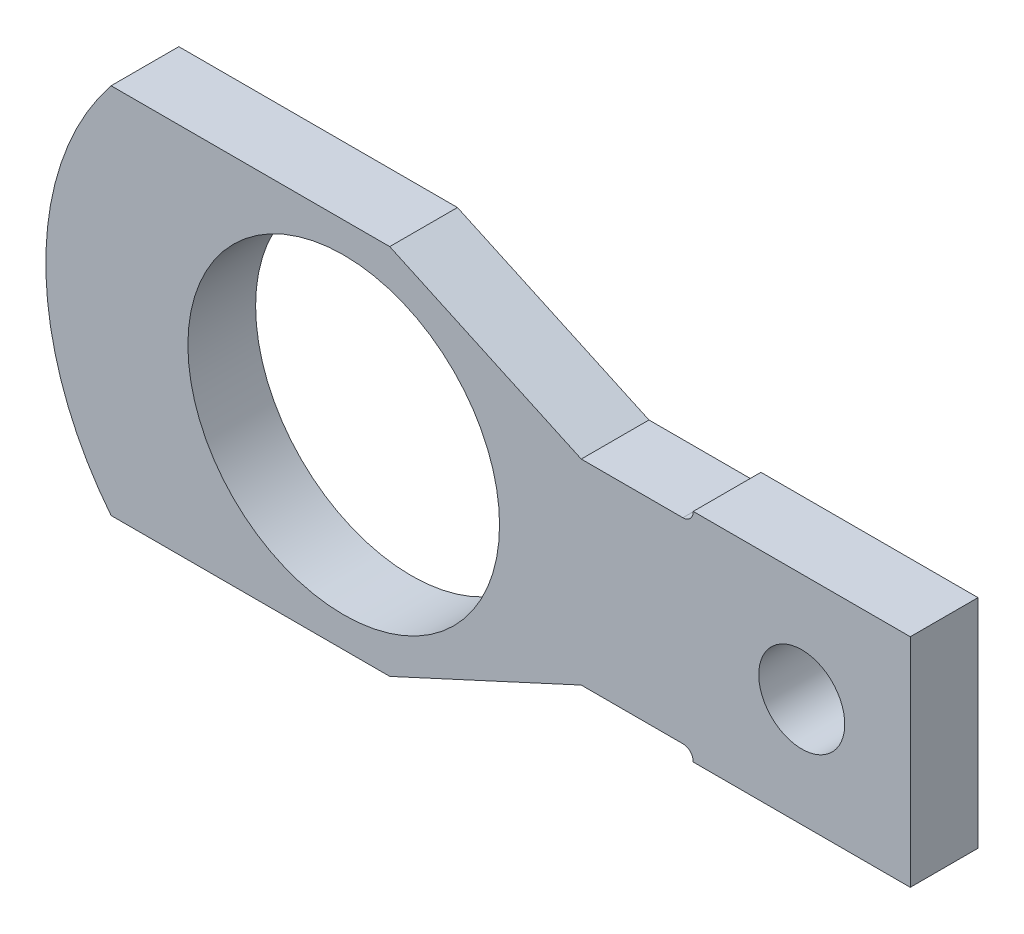
ISO-10303-21;
HEADER;
FILE_DESCRIPTION(('STEP AP214'),'2;1');
FILE_NAME('part.step','',(''),(''),'','','');
FILE_SCHEMA(('AUTOMOTIVE_DESIGN { 1 0 10303 214 1 1 1 1 }'));
ENDSEC;
DATA;
#1=APPLICATION_CONTEXT('core data for automotive mechanical design processes');
#2=APPLICATION_PROTOCOL_DEFINITION('international standard','automotive_design',2000,#1);
#3=PRODUCT_CONTEXT('',#1,'mechanical');
#4=PRODUCT('Part','Part','',(#3));
#5=PRODUCT_RELATED_PRODUCT_CATEGORY('part','',(#4));
#6=PRODUCT_DEFINITION_FORMATION('','',#4);
#7=PRODUCT_DEFINITION_CONTEXT('part definition',#1,'design');
#8=PRODUCT_DEFINITION('design','',#6,#7);
#9=PRODUCT_DEFINITION_SHAPE('','',#8);
#10=(LENGTH_UNIT() NAMED_UNIT(*) SI_UNIT(.MILLI.,.METRE.));
#11=(NAMED_UNIT(*) PLANE_ANGLE_UNIT() SI_UNIT($,.RADIAN.));
#12=(NAMED_UNIT(*) SI_UNIT($,.STERADIAN.) SOLID_ANGLE_UNIT());
#13=UNCERTAINTY_MEASURE_WITH_UNIT(LENGTH_MEASURE(1.E-05),#10,'distance_accuracy_value','');
#14=(GEOMETRIC_REPRESENTATION_CONTEXT(3) GLOBAL_UNCERTAINTY_ASSIGNED_CONTEXT((#13)) GLOBAL_UNIT_ASSIGNED_CONTEXT((#10,
#11,#12)) REPRESENTATION_CONTEXT('',''));
#15=CARTESIAN_POINT('',(0.,0.,0.));
#16=DIRECTION('',(0.,0.,1.));
#17=DIRECTION('',(1.,0.,0.));
#18=AXIS2_PLACEMENT_3D('',#15,#16,#17);
#19=CARTESIAN_POINT('',(250.444,79.8830000000009,50.));
#20=DIRECTION('',(0.,0.,1.));
#21=DIRECTION('',(0.,1.,0.));
#22=AXIS2_PLACEMENT_3D('',#19,#20,#21);
#23=PLANE('',#22);
#24=CARTESIAN_POINT('',(338.201,1.23936402628837E-12,50.));
#25=DIRECTION('',(0.,0.,1.));
#26=DIRECTION('',(0.,1.,0.));
#27=AXIS2_PLACEMENT_3D('',#24,#25,#26);
#28=CIRCLE('',#27,31.75);
#29=CARTESIAN_POINT('',(338.201,31.7500000000013,50.));
#30=VERTEX_POINT('',#29);
#31=EDGE_CURVE('E288',#30,#30,#28,.T.);
#32=ORIENTED_EDGE('',*,*,#31,.F.);
#33=EDGE_LOOP('',(#32));
#34=FACE_BOUND('',#33,.T.);
#35=DIRECTION('',(1.,0.,0.));
#36=VECTOR('',#35,1.);
#37=CARTESIAN_POINT('',(-171.760163891399,137.413999999999,50.));
#38=LINE('',#37,#36);
#39=CARTESIAN_POINT('',(-171.760163891399,137.413999999999,50.));
#40=VERTEX_POINT('',#39);
#41=CARTESIAN_POINT('',(33.9798361086012,137.414,50.));
#42=VERTEX_POINT('',#41);
#43=EDGE_CURVE('E331',#40,#42,#38,.T.);
#44=ORIENTED_EDGE('',*,*,#43,.F.);
#45=CARTESIAN_POINT('',(0.,0.,50.));
#46=DIRECTION('',(0.,0.,1.));
#47=DIRECTION('',(0.,1.,0.));
#48=AXIS2_PLACEMENT_3D('',#45,#46,#47);
#49=CIRCLE('',#48,219.964);
#50=CARTESIAN_POINT('',(-171.760163891398,-137.414000000001,50.));
#51=VERTEX_POINT('',#50);
#52=EDGE_CURVE('E257',#40,#51,#49,.T.);
#53=ORIENTED_EDGE('',*,*,#52,.T.);
#54=DIRECTION('',(1.,0.,0.));
#55=VECTOR('',#54,1.);
#56=CARTESIAN_POINT('',(-171.760163891398,-137.414000000001,50.));
#57=LINE('',#56,#55);
#58=CARTESIAN_POINT('',(33.9798361086022,-137.414,50.));
#59=VERTEX_POINT('',#58);
#60=EDGE_CURVE('E249',#51,#59,#57,.T.);
#61=ORIENTED_EDGE('',*,*,#60,.T.);
#62=DIRECTION('',(0.908247237806105,0.418433931484506,0.));
#63=VECTOR('',#62,1.);
#64=CARTESIAN_POINT('',(33.9798361086022,-137.414,50.));
#65=LINE('',#64,#63);
#66=CARTESIAN_POINT('',(175.395747529488,-72.2629999999993,50.));
#67=VERTEX_POINT('',#66);
#68=EDGE_CURVE('E255',#59,#67,#65,.T.);
#69=ORIENTED_EDGE('',*,*,#68,.T.);
#70=DIRECTION('',(-1.,0.,0.));
#71=VECTOR('',#70,1.);
#72=CARTESIAN_POINT('',(250.444,-72.2629999999991,50.));
#73=LINE('',#72,#71);
#74=CARTESIAN_POINT('',(250.444,-72.2629999999991,50.));
#75=VERTEX_POINT('',#74);
#76=EDGE_CURVE('E274',#75,#67,#73,.T.);
#77=ORIENTED_EDGE('',*,*,#76,.F.);
#78=CARTESIAN_POINT('',(250.444,-79.8829999999991,50.));
#79=DIRECTION('',(0.,0.,-1.));
#80=DIRECTION('',(0.,-1.,0.));
#81=AXIS2_PLACEMENT_3D('',#78,#79,#80);
#82=CIRCLE('',#81,7.62000000000001);
#83=CARTESIAN_POINT('',(258.064,-79.8829999999991,50.));
#84=VERTEX_POINT('',#83);
#85=EDGE_CURVE('E277',#75,#84,#82,.T.);
#86=ORIENTED_EDGE('',*,*,#85,.T.);
#87=DIRECTION('',(0.,1.,0.));
#88=VECTOR('',#87,1.);
#89=CARTESIAN_POINT('',(258.064,-80.136999999999,50.));
#90=LINE('',#89,#88);
#91=CARTESIAN_POINT('',(258.064,-80.136999999999,50.));
#92=VERTEX_POINT('',#91);
#93=EDGE_CURVE('E379',#92,#84,#90,.T.);
#94=ORIENTED_EDGE('',*,*,#93,.F.);
#95=DIRECTION('',(1.,0.,0.));
#96=VECTOR('',#95,1.);
#97=CARTESIAN_POINT('',(258.064,-80.136999999999,50.));
#98=LINE('',#97,#96);
#99=CARTESIAN_POINT('',(418.338,-80.1369999999985,50.));
#100=VERTEX_POINT('',#99);
#101=EDGE_CURVE('E388',#92,#100,#98,.T.);
#102=ORIENTED_EDGE('',*,*,#101,.T.);
#103=DIRECTION('',(0.,1.,0.));
#104=VECTOR('',#103,1.);
#105=CARTESIAN_POINT('',(418.338,-80.1369999999985,50.));
#106=LINE('',#105,#104);
#107=CARTESIAN_POINT('',(418.338,80.1370000000015,50.));
#108=VERTEX_POINT('',#107);
#109=EDGE_CURVE('E391',#100,#108,#106,.T.);
#110=ORIENTED_EDGE('',*,*,#109,.T.);
#111=DIRECTION('',(1.,0.,0.));
#112=VECTOR('',#111,1.);
#113=CARTESIAN_POINT('',(258.064,80.1370000000009,50.));
#114=LINE('',#113,#112);
#115=CARTESIAN_POINT('',(258.064,80.1370000000009,50.));
#116=VERTEX_POINT('',#115);
#117=EDGE_CURVE('E396',#116,#108,#114,.T.);
#118=ORIENTED_EDGE('',*,*,#117,.F.);
#119=DIRECTION('',(0.,1.,0.));
#120=VECTOR('',#119,1.);
#121=CARTESIAN_POINT('',(258.064,79.883000000001,50.));
#122=LINE('',#121,#120);
#123=CARTESIAN_POINT('',(258.064,79.883000000001,50.));
#124=VERTEX_POINT('',#123);
#125=EDGE_CURVE('E400',#124,#116,#122,.T.);
#126=ORIENTED_EDGE('',*,*,#125,.F.);
#127=CARTESIAN_POINT('',(250.444,79.8830000000009,50.));
#128=DIRECTION('',(0.,0.,1.));
#129=DIRECTION('',(0.,1.,0.));
#130=AXIS2_PLACEMENT_3D('',#127,#128,#129);
#131=CIRCLE('',#130,7.62000000000001);
#132=CARTESIAN_POINT('',(250.444,72.2630000000009,50.));
#133=VERTEX_POINT('',#132);
#134=EDGE_CURVE('E404',#133,#124,#131,.T.);
#135=ORIENTED_EDGE('',*,*,#134,.F.);
#136=DIRECTION('',(1.,0.,0.));
#137=VECTOR('',#136,1.);
#138=CARTESIAN_POINT('',(175.395747529488,72.2630000000006,50.));
#139=LINE('',#138,#137);
#140=CARTESIAN_POINT('',(175.395747529488,72.2630000000006,50.));
#141=VERTEX_POINT('',#140);
#142=EDGE_CURVE('E408',#141,#133,#139,.T.);
#143=ORIENTED_EDGE('',*,*,#142,.F.);
#144=DIRECTION('',(0.908247237806108,-0.418433931484499,0.));
#145=VECTOR('',#144,1.);
#146=CARTESIAN_POINT('',(33.9798361086012,137.414,50.));
#147=LINE('',#146,#145);
#148=EDGE_CURVE('E411',#42,#141,#147,.T.);
#149=ORIENTED_EDGE('',*,*,#148,.F.);
#150=EDGE_LOOP('',(#44,#53,#61,#69,#77,#86,#94,#102,#110,#118,#126,#135,#143,#149));
#151=FACE_BOUND('',#150,.T.);
#152=CARTESIAN_POINT('',(0.,0.,50.));
#153=DIRECTION('',(0.,0.,1.));
#154=DIRECTION('',(0.,1.,0.));
#155=AXIS2_PLACEMENT_3D('',#152,#153,#154);
#156=CIRCLE('',#155,115.062);
#157=CARTESIAN_POINT('',(-4.01736825809969E-13,115.062,50.));
#158=VERTEX_POINT('',#157);
#159=EDGE_CURVE('E420',#158,#158,#156,.T.);
#160=ORIENTED_EDGE('',*,*,#159,.F.);
#161=EDGE_LOOP('',(#160));
#162=FACE_BOUND('',#161,.T.);
#163=ADVANCED_FACE('F141',(#34,#151,#162),#23,.T.);
#164=CARTESIAN_POINT('',(250.444,79.8830000000009,0.));
#165=DIRECTION('',(0.,0.,1.));
#166=DIRECTION('',(0.,1.,0.));
#167=AXIS2_PLACEMENT_3D('',#164,#165,#166);
#168=PLANE('',#167);
#169=CARTESIAN_POINT('',(338.201,1.23936402628837E-12,0.));
#170=DIRECTION('',(0.,0.,1.));
#171=DIRECTION('',(0.,1.,0.));
#172=AXIS2_PLACEMENT_3D('',#169,#170,#171);
#173=CIRCLE('',#172,31.75);
#174=CARTESIAN_POINT('',(338.201,31.7500000000013,0.));
#175=VERTEX_POINT('',#174);
#176=EDGE_CURVE('E416',#175,#175,#173,.T.);
#177=ORIENTED_EDGE('',*,*,#176,.T.);
#178=EDGE_LOOP('',(#177));
#179=FACE_BOUND('',#178,.T.);
#180=DIRECTION('',(1.,0.,0.));
#181=VECTOR('',#180,1.);
#182=CARTESIAN_POINT('',(-171.760163891399,137.413999999999,0.));
#183=LINE('',#182,#181);
#184=CARTESIAN_POINT('',(-171.760163891399,137.413999999999,0.));
#185=VERTEX_POINT('',#184);
#186=CARTESIAN_POINT('',(33.9798361086012,137.414,0.));
#187=VERTEX_POINT('',#186);
#188=EDGE_CURVE('E283',#185,#187,#183,.T.);
#189=ORIENTED_EDGE('',*,*,#188,.T.);
#190=DIRECTION('',(0.908247237806108,-0.418433931484499,0.));
#191=VECTOR('',#190,1.);
#192=CARTESIAN_POINT('',(33.9798361086012,137.414,0.));
#193=LINE('',#192,#191);
#194=CARTESIAN_POINT('',(175.395747529488,72.2630000000006,0.));
#195=VERTEX_POINT('',#194);
#196=EDGE_CURVE('E287',#187,#195,#193,.T.);
#197=ORIENTED_EDGE('',*,*,#196,.T.);
#198=DIRECTION('',(-1.,0.,0.));
#199=VECTOR('',#198,1.);
#200=CARTESIAN_POINT('',(250.444,72.2630000000009,0.));
#201=LINE('',#200,#199);
#202=CARTESIAN_POINT('',(250.444,72.2630000000009,0.));
#203=VERTEX_POINT('',#202);
#204=EDGE_CURVE('E292',#203,#195,#201,.T.);
#205=ORIENTED_EDGE('',*,*,#204,.F.);
#206=CARTESIAN_POINT('',(250.444,79.8830000000009,0.));
#207=DIRECTION('',(0.,0.,1.));
#208=DIRECTION('',(0.,1.,0.));
#209=AXIS2_PLACEMENT_3D('',#206,#207,#208);
#210=CIRCLE('',#209,7.62000000000001);
#211=CARTESIAN_POINT('',(258.064,79.883000000001,0.));
#212=VERTEX_POINT('',#211);
#213=EDGE_CURVE('E295',#203,#212,#210,.T.);
#214=ORIENTED_EDGE('',*,*,#213,.T.);
#215=DIRECTION('',(0.,1.,0.));
#216=VECTOR('',#215,1.);
#217=CARTESIAN_POINT('',(258.064,79.883000000001,0.));
#218=LINE('',#217,#216);
#219=CARTESIAN_POINT('',(258.064,80.1370000000009,0.));
#220=VERTEX_POINT('',#219);
#221=EDGE_CURVE('E299',#212,#220,#218,.T.);
#222=ORIENTED_EDGE('',*,*,#221,.T.);
#223=DIRECTION('',(1.,0.,0.));
#224=VECTOR('',#223,1.);
#225=CARTESIAN_POINT('',(258.064,80.1370000000009,0.));
#226=LINE('',#225,#224);
#227=CARTESIAN_POINT('',(418.338,80.1370000000015,0.));
#228=VERTEX_POINT('',#227);
#229=EDGE_CURVE('E303',#220,#228,#226,.T.);
#230=ORIENTED_EDGE('',*,*,#229,.T.);
#231=DIRECTION('',(0.,1.,0.));
#232=VECTOR('',#231,1.);
#233=CARTESIAN_POINT('',(418.338,-80.1369999999985,0.));
#234=LINE('',#233,#232);
#235=CARTESIAN_POINT('',(418.338,-80.1369999999985,0.));
#236=VERTEX_POINT('',#235);
#237=EDGE_CURVE('E307',#236,#228,#234,.T.);
#238=ORIENTED_EDGE('',*,*,#237,.F.);
#239=DIRECTION('',(1.,0.,0.));
#240=VECTOR('',#239,1.);
#241=CARTESIAN_POINT('',(258.064,-80.136999999999,0.));
#242=LINE('',#241,#240);
#243=CARTESIAN_POINT('',(258.064,-80.136999999999,0.));
#244=VERTEX_POINT('',#243);
#245=EDGE_CURVE('E311',#244,#236,#242,.T.);
#246=ORIENTED_EDGE('',*,*,#245,.F.);
#247=DIRECTION('',(0.,1.,0.));
#248=VECTOR('',#247,1.);
#249=CARTESIAN_POINT('',(258.064,-80.136999999999,0.));
#250=LINE('',#249,#248);
#251=CARTESIAN_POINT('',(258.064,-79.8829999999991,0.));
#252=VERTEX_POINT('',#251);
#253=EDGE_CURVE('E314',#244,#252,#250,.T.);
#254=ORIENTED_EDGE('',*,*,#253,.T.);
#255=CARTESIAN_POINT('',(250.444,-79.8829999999991,0.));
#256=DIRECTION('',(0.,0.,-1.));
#257=DIRECTION('',(0.,-1.,0.));
#258=AXIS2_PLACEMENT_3D('',#255,#256,#257);
#259=CIRCLE('',#258,7.62000000000001);
#260=CARTESIAN_POINT('',(250.444,-72.2629999999991,0.));
#261=VERTEX_POINT('',#260);
#262=EDGE_CURVE('E318',#261,#252,#259,.T.);
#263=ORIENTED_EDGE('',*,*,#262,.F.);
#264=DIRECTION('',(1.,0.,0.));
#265=VECTOR('',#264,1.);
#266=CARTESIAN_POINT('',(175.395747529488,-72.2629999999993,0.));
#267=LINE('',#266,#265);
#268=CARTESIAN_POINT('',(175.395747529488,-72.2629999999993,0.));
#269=VERTEX_POINT('',#268);
#270=EDGE_CURVE('E322',#269,#261,#267,.T.);
#271=ORIENTED_EDGE('',*,*,#270,.F.);
#272=DIRECTION('',(0.908247237806105,0.418433931484506,0.));
#273=VECTOR('',#272,1.);
#274=CARTESIAN_POINT('',(33.9798361086022,-137.414,0.));
#275=LINE('',#274,#273);
#276=CARTESIAN_POINT('',(33.9798361086022,-137.414,0.));
#277=VERTEX_POINT('',#276);
#278=EDGE_CURVE('E325',#277,#269,#275,.T.);
#279=ORIENTED_EDGE('',*,*,#278,.F.);
#280=DIRECTION('',(1.,0.,0.));
#281=VECTOR('',#280,1.);
#282=CARTESIAN_POINT('',(-171.760163891398,-137.414000000001,0.));
#283=LINE('',#282,#281);
#284=CARTESIAN_POINT('',(-171.760163891398,-137.414000000001,0.));
#285=VERTEX_POINT('',#284);
#286=EDGE_CURVE('E265',#285,#277,#283,.T.);
#287=ORIENTED_EDGE('',*,*,#286,.F.);
#288=CARTESIAN_POINT('',(0.,0.,0.));
#289=DIRECTION('',(0.,0.,1.));
#290=DIRECTION('',(0.,1.,0.));
#291=AXIS2_PLACEMENT_3D('',#288,#289,#290);
#292=CIRCLE('',#291,219.964);
#293=EDGE_CURVE('E206',#185,#285,#292,.T.);
#294=ORIENTED_EDGE('',*,*,#293,.F.);
#295=EDGE_LOOP('',(#189,#197,#205,#214,#222,#230,#238,#246,#254,#263,#271,#279,#287,#294));
#296=FACE_BOUND('',#295,.T.);
#297=CARTESIAN_POINT('',(0.,0.,0.));
#298=DIRECTION('',(0.,0.,1.));
#299=DIRECTION('',(0.,1.,0.));
#300=AXIS2_PLACEMENT_3D('',#297,#298,#299);
#301=CIRCLE('',#300,115.062);
#302=CARTESIAN_POINT('',(-4.01736825809969E-13,115.062,0.));
#303=VERTEX_POINT('',#302);
#304=EDGE_CURVE('E424',#303,#303,#301,.T.);
#305=ORIENTED_EDGE('',*,*,#304,.T.);
#306=EDGE_LOOP('',(#305));
#307=FACE_BOUND('',#306,.T.);
#308=ADVANCED_FACE('F369',(#179,#296,#307),#168,.F.);
#309=CARTESIAN_POINT('',(-171.760163891399,137.413999999999,50.));
#310=DIRECTION('',(0.,1.,0.));
#311=DIRECTION('',(-1.,0.,0.));
#312=AXIS2_PLACEMENT_3D('',#309,#310,#311);
#313=PLANE('',#312);
#314=ORIENTED_EDGE('',*,*,#188,.F.);
#315=DIRECTION('',(0.,0.,-1.));
#316=VECTOR('',#315,1.);
#317=CARTESIAN_POINT('',(-171.760163891399,137.413999999999,50.));
#318=LINE('',#317,#316);
#319=EDGE_CURVE('E12',#40,#185,#318,.T.);
#320=ORIENTED_EDGE('',*,*,#319,.F.);
#321=ORIENTED_EDGE('',*,*,#43,.T.);
#322=DIRECTION('',(0.,0.,-1.));
#323=VECTOR('',#322,1.);
#324=CARTESIAN_POINT('',(33.9798361086012,137.414,50.));
#325=LINE('',#324,#323);
#326=EDGE_CURVE('E145',#42,#187,#325,.T.);
#327=ORIENTED_EDGE('',*,*,#326,.T.);
#328=EDGE_LOOP('',(#314,#320,#321,#327));
#329=FACE_BOUND('',#328,.T.);
#330=ADVANCED_FACE('F143',(#329),#313,.T.);
#331=CARTESIAN_POINT('',(0.,0.,50.));
#332=DIRECTION('',(0.,0.,-1.));
#333=DIRECTION('',(0.,-1.,0.));
#334=AXIS2_PLACEMENT_3D('',#331,#332,#333);
#335=CYLINDRICAL_SURFACE('',#334,219.964);
#336=ORIENTED_EDGE('',*,*,#293,.T.);
#337=DIRECTION('',(0.,0.,-1.));
#338=VECTOR('',#337,1.);
#339=CARTESIAN_POINT('',(-171.760163891398,-137.414000000001,50.));
#340=LINE('',#339,#338);
#341=EDGE_CURVE('E152',#51,#285,#340,.T.);
#342=ORIENTED_EDGE('',*,*,#341,.F.);
#343=ORIENTED_EDGE('',*,*,#52,.F.);
#344=ORIENTED_EDGE('',*,*,#319,.T.);
#345=EDGE_LOOP('',(#336,#342,#343,#344));
#346=FACE_BOUND('',#345,.T.);
#347=ADVANCED_FACE('F447',(#346),#335,.T.);
#348=CARTESIAN_POINT('',(-171.760163891398,-137.414000000001,50.));
#349=DIRECTION('',(0.,1.,0.));
#350=DIRECTION('',(0.,0.,-1.));
#351=AXIS2_PLACEMENT_3D('',#348,#349,#350);
#352=PLANE('',#351);
#353=ORIENTED_EDGE('',*,*,#286,.T.);
#354=DIRECTION('',(0.,0.,-1.));
#355=VECTOR('',#354,1.);
#356=CARTESIAN_POINT('',(33.9798361086022,-137.414,50.));
#357=LINE('',#356,#355);
#358=EDGE_CURVE('E262',#59,#277,#357,.T.);
#359=ORIENTED_EDGE('',*,*,#358,.F.);
#360=ORIENTED_EDGE('',*,*,#60,.F.);
#361=ORIENTED_EDGE('',*,*,#341,.T.);
#362=EDGE_LOOP('',(#353,#359,#360,#361));
#363=FACE_BOUND('',#362,.T.);
#364=ADVANCED_FACE('F263',(#363),#352,.F.);
#365=CARTESIAN_POINT('',(33.9798361086022,-137.414,50.));
#366=DIRECTION('',(-0.418433931484506,0.908247237806105,0.));
#367=DIRECTION('',(-0.908247237806105,-0.418433931484506,0.));
#368=AXIS2_PLACEMENT_3D('',#365,#366,#367);
#369=PLANE('',#368);
#370=ORIENTED_EDGE('',*,*,#278,.T.);
#371=DIRECTION('',(0.,0.,-1.));
#372=VECTOR('',#371,1.);
#373=CARTESIAN_POINT('',(175.395747529488,-72.2629999999993,50.));
#374=LINE('',#373,#372);
#375=EDGE_CURVE('E269',#67,#269,#374,.T.);
#376=ORIENTED_EDGE('',*,*,#375,.F.);
#377=ORIENTED_EDGE('',*,*,#68,.F.);
#378=ORIENTED_EDGE('',*,*,#358,.T.);
#379=EDGE_LOOP('',(#370,#376,#377,#378));
#380=FACE_BOUND('',#379,.T.);
#381=ADVANCED_FACE('F271',(#380),#369,.F.);
#382=CARTESIAN_POINT('',(175.395747529488,-72.2629999999993,50.));
#383=DIRECTION('',(0.,1.,0.));
#384=DIRECTION('',(0.,0.,-1.));
#385=AXIS2_PLACEMENT_3D('',#382,#383,#384);
#386=PLANE('',#385);
#387=ORIENTED_EDGE('',*,*,#270,.T.);
#388=DIRECTION('',(0.,0.,-1.));
#389=VECTOR('',#388,1.);
#390=CARTESIAN_POINT('',(250.444,-72.2629999999991,50.));
#391=LINE('',#390,#389);
#392=EDGE_CURVE('E337',#75,#261,#391,.T.);
#393=ORIENTED_EDGE('',*,*,#392,.F.);
#394=ORIENTED_EDGE('',*,*,#76,.T.);
#395=ORIENTED_EDGE('',*,*,#375,.T.);
#396=EDGE_LOOP('',(#387,#393,#394,#395));
#397=FACE_BOUND('',#396,.T.);
#398=ADVANCED_FACE('F374',(#397),#386,.F.);
#399=CARTESIAN_POINT('',(250.444,-79.8829999999991,50.));
#400=DIRECTION('',(0.,0.,-1.));
#401=DIRECTION('',(0.,-1.,0.));
#402=AXIS2_PLACEMENT_3D('',#399,#400,#401);
#403=CYLINDRICAL_SURFACE('',#402,7.62000000000001);
#404=ORIENTED_EDGE('',*,*,#262,.T.);
#405=DIRECTION('',(0.,0.,-1.));
#406=VECTOR('',#405,1.);
#407=CARTESIAN_POINT('',(258.064,-79.8829999999991,50.));
#408=LINE('',#407,#406);
#409=EDGE_CURVE('E341',#84,#252,#408,.T.);
#410=ORIENTED_EDGE('',*,*,#409,.F.);
#411=ORIENTED_EDGE('',*,*,#85,.F.);
#412=ORIENTED_EDGE('',*,*,#392,.T.);
#413=EDGE_LOOP('',(#404,#410,#411,#412));
#414=FACE_BOUND('',#413,.T.);
#415=ADVANCED_FACE('F382',(#414),#403,.F.);
#416=CARTESIAN_POINT('',(258.064,-80.136999999999,50.));
#417=DIRECTION('',(-1.,0.,0.));
#418=DIRECTION('',(0.,0.,1.));
#419=AXIS2_PLACEMENT_3D('',#416,#417,#418);
#420=PLANE('',#419);
#421=ORIENTED_EDGE('',*,*,#253,.F.);
#422=DIRECTION('',(0.,0.,-1.));
#423=VECTOR('',#422,1.);
#424=CARTESIAN_POINT('',(258.064,-80.136999999999,50.));
#425=LINE('',#424,#423);
#426=EDGE_CURVE('E344',#92,#244,#425,.T.);
#427=ORIENTED_EDGE('',*,*,#426,.F.);
#428=ORIENTED_EDGE('',*,*,#93,.T.);
#429=ORIENTED_EDGE('',*,*,#409,.T.);
#430=EDGE_LOOP('',(#421,#427,#428,#429));
#431=FACE_BOUND('',#430,.T.);
#432=ADVANCED_FACE('F385',(#431),#420,.T.);
#433=CARTESIAN_POINT('',(258.064,-80.136999999999,50.));
#434=DIRECTION('',(0.,1.,0.));
#435=DIRECTION('',(0.,0.,-1.));
#436=AXIS2_PLACEMENT_3D('',#433,#434,#435);
#437=PLANE('',#436);
#438=ORIENTED_EDGE('',*,*,#245,.T.);
#439=DIRECTION('',(0.,0.,-1.));
#440=VECTOR('',#439,1.);
#441=CARTESIAN_POINT('',(418.338,-80.1369999999985,50.));
#442=LINE('',#441,#440);
#443=EDGE_CURVE('E347',#100,#236,#442,.T.);
#444=ORIENTED_EDGE('',*,*,#443,.F.);
#445=ORIENTED_EDGE('',*,*,#101,.F.);
#446=ORIENTED_EDGE('',*,*,#426,.T.);
#447=EDGE_LOOP('',(#438,#444,#445,#446));
#448=FACE_BOUND('',#447,.T.);
#449=ADVANCED_FACE('F460',(#448),#437,.F.);
#450=CARTESIAN_POINT('',(418.338,-80.1369999999985,50.));
#451=DIRECTION('',(-1.,0.,0.));
#452=DIRECTION('',(0.,0.,1.));
#453=AXIS2_PLACEMENT_3D('',#450,#451,#452);
#454=PLANE('',#453);
#455=ORIENTED_EDGE('',*,*,#237,.T.);
#456=DIRECTION('',(0.,0.,-1.));
#457=VECTOR('',#456,1.);
#458=CARTESIAN_POINT('',(418.338,80.1370000000015,50.));
#459=LINE('',#458,#457);
#460=EDGE_CURVE('E351',#108,#228,#459,.T.);
#461=ORIENTED_EDGE('',*,*,#460,.F.);
#462=ORIENTED_EDGE('',*,*,#109,.F.);
#463=ORIENTED_EDGE('',*,*,#443,.T.);
#464=EDGE_LOOP('',(#455,#461,#462,#463));
#465=FACE_BOUND('',#464,.T.);
#466=ADVANCED_FACE('F463',(#465),#454,.F.);
#467=CARTESIAN_POINT('',(258.064,80.1370000000009,50.));
#468=DIRECTION('',(0.,1.,0.));
#469=DIRECTION('',(0.,0.,-1.));
#470=AXIS2_PLACEMENT_3D('',#467,#468,#469);
#471=PLANE('',#470);
#472=ORIENTED_EDGE('',*,*,#229,.F.);
#473=DIRECTION('',(0.,0.,-1.));
#474=VECTOR('',#473,1.);
#475=CARTESIAN_POINT('',(258.064,80.1370000000009,50.));
#476=LINE('',#475,#474);
#477=EDGE_CURVE('E354',#116,#220,#476,.T.);
#478=ORIENTED_EDGE('',*,*,#477,.F.);
#479=ORIENTED_EDGE('',*,*,#117,.T.);
#480=ORIENTED_EDGE('',*,*,#460,.T.);
#481=EDGE_LOOP('',(#472,#478,#479,#480));
#482=FACE_BOUND('',#481,.T.);
#483=ADVANCED_FACE('F467',(#482),#471,.T.);
#484=CARTESIAN_POINT('',(258.064,79.883000000001,50.));
#485=DIRECTION('',(-1.,0.,0.));
#486=DIRECTION('',(0.,0.,1.));
#487=AXIS2_PLACEMENT_3D('',#484,#485,#486);
#488=PLANE('',#487);
#489=ORIENTED_EDGE('',*,*,#221,.F.);
#490=DIRECTION('',(0.,0.,-1.));
#491=VECTOR('',#490,1.);
#492=CARTESIAN_POINT('',(258.064,79.883000000001,50.));
#493=LINE('',#492,#491);
#494=EDGE_CURVE('E357',#124,#212,#493,.T.);
#495=ORIENTED_EDGE('',*,*,#494,.F.);
#496=ORIENTED_EDGE('',*,*,#125,.T.);
#497=ORIENTED_EDGE('',*,*,#477,.T.);
#498=EDGE_LOOP('',(#489,#495,#496,#497));
#499=FACE_BOUND('',#498,.T.);
#500=ADVANCED_FACE('F471',(#499),#488,.T.);
#501=CARTESIAN_POINT('',(250.444,79.8830000000009,50.));
#502=DIRECTION('',(0.,0.,-1.));
#503=DIRECTION('',(0.,-1.,0.));
#504=AXIS2_PLACEMENT_3D('',#501,#502,#503);
#505=CYLINDRICAL_SURFACE('',#504,7.62000000000001);
#506=ORIENTED_EDGE('',*,*,#213,.F.);
#507=DIRECTION('',(0.,0.,-1.));
#508=VECTOR('',#507,1.);
#509=CARTESIAN_POINT('',(250.444,72.2630000000009,50.));
#510=LINE('',#509,#508);
#511=EDGE_CURVE('E360',#133,#203,#510,.T.);
#512=ORIENTED_EDGE('',*,*,#511,.F.);
#513=ORIENTED_EDGE('',*,*,#134,.T.);
#514=ORIENTED_EDGE('',*,*,#494,.T.);
#515=EDGE_LOOP('',(#506,#512,#513,#514));
#516=FACE_BOUND('',#515,.T.);
#517=ADVANCED_FACE('F475',(#516),#505,.F.);
#518=CARTESIAN_POINT('',(250.444,72.2630000000009,50.));
#519=DIRECTION('',(0.,-1.,0.));
#520=DIRECTION('',(0.,0.,1.));
#521=AXIS2_PLACEMENT_3D('',#518,#519,#520);
#522=PLANE('',#521);
#523=ORIENTED_EDGE('',*,*,#204,.T.);
#524=DIRECTION('',(0.,0.,-1.));
#525=VECTOR('',#524,1.);
#526=CARTESIAN_POINT('',(175.395747529488,72.2630000000006,50.));
#527=LINE('',#526,#525);
#528=EDGE_CURVE('E362',#141,#195,#527,.T.);
#529=ORIENTED_EDGE('',*,*,#528,.F.);
#530=ORIENTED_EDGE('',*,*,#142,.T.);
#531=ORIENTED_EDGE('',*,*,#511,.T.);
#532=EDGE_LOOP('',(#523,#529,#530,#531));
#533=FACE_BOUND('',#532,.T.);
#534=ADVANCED_FACE('F479',(#533),#522,.F.);
#535=CARTESIAN_POINT('',(33.9798361086012,137.414,50.));
#536=DIRECTION('',(0.418433931484499,0.908247237806108,0.));
#537=DIRECTION('',(-0.908247237806108,0.418433931484499,0.));
#538=AXIS2_PLACEMENT_3D('',#535,#536,#537);
#539=PLANE('',#538);
#540=ORIENTED_EDGE('',*,*,#196,.F.);
#541=ORIENTED_EDGE('',*,*,#326,.F.);
#542=ORIENTED_EDGE('',*,*,#148,.T.);
#543=ORIENTED_EDGE('',*,*,#528,.T.);
#544=EDGE_LOOP('',(#540,#541,#542,#543));
#545=FACE_BOUND('',#544,.T.);
#546=ADVANCED_FACE('F366',(#545),#539,.T.);
#547=CARTESIAN_POINT('',(338.201,1.23936402628837E-12,50.));
#548=DIRECTION('',(0.,0.,-1.));
#549=DIRECTION('',(0.,-1.,0.));
#550=AXIS2_PLACEMENT_3D('',#547,#548,#549);
#551=CYLINDRICAL_SURFACE('',#550,31.75);
#552=ORIENTED_EDGE('',*,*,#31,.T.);
#553=EDGE_LOOP('',(#552));
#554=FACE_BOUND('',#553,.T.);
#555=ORIENTED_EDGE('',*,*,#176,.F.);
#556=EDGE_LOOP('',(#555));
#557=FACE_BOUND('',#556,.T.);
#558=ADVANCED_FACE('F444',(#554,#557),#551,.F.);
#559=CARTESIAN_POINT('',(0.,0.,50.));
#560=DIRECTION('',(0.,0.,-1.));
#561=DIRECTION('',(0.,-1.,0.));
#562=AXIS2_PLACEMENT_3D('',#559,#560,#561);
#563=CYLINDRICAL_SURFACE('',#562,115.062);
#564=ORIENTED_EDGE('',*,*,#159,.T.);
#565=EDGE_LOOP('',(#564));
#566=FACE_BOUND('',#565,.T.);
#567=ORIENTED_EDGE('',*,*,#304,.F.);
#568=EDGE_LOOP('',(#567));
#569=FACE_BOUND('',#568,.T.);
#570=ADVANCED_FACE('F432',(#566,#569),#563,.F.);
#571=CLOSED_SHELL('',(#163,#308,#330,#347,#364,#381,#398,#415,#432,#449,#466,#483,#500,#517,
#534,#546,#558,#570));
#572=MANIFOLD_SOLID_BREP('B2',#571);
#573=ADVANCED_BREP_SHAPE_REPRESENTATION('',(#18,#572),#14);
#574=SHAPE_DEFINITION_REPRESENTATION(#9,#573);
ENDSEC;
END-ISO-10303-21;
